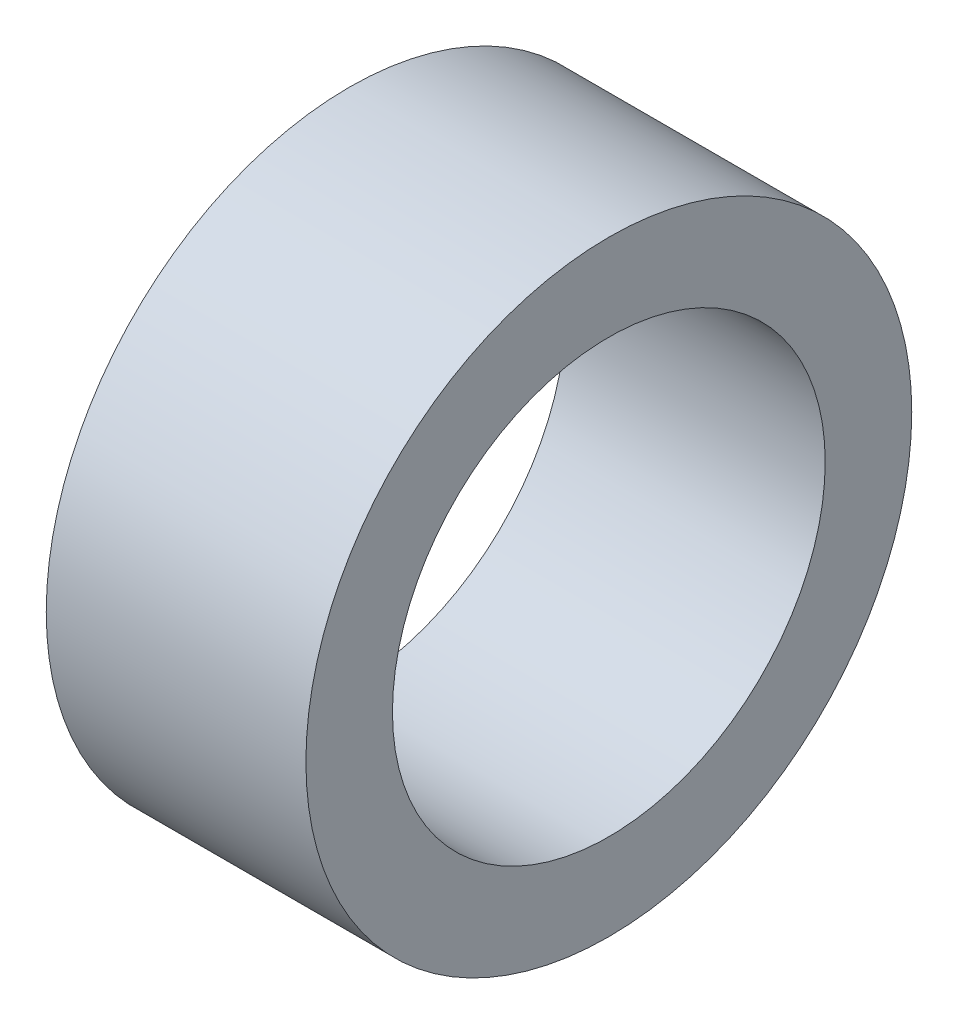
ISO-10303-21;
HEADER;
FILE_DESCRIPTION(('STEP AP214'),'2;1');
FILE_NAME('part.step','',(''),(''),'','','');
FILE_SCHEMA(('AUTOMOTIVE_DESIGN { 1 0 10303 214 1 1 1 1 }'));
ENDSEC;
DATA;
#1=APPLICATION_CONTEXT('core data for automotive mechanical design processes');
#2=APPLICATION_PROTOCOL_DEFINITION('international standard','automotive_design',2000,#1);
#3=PRODUCT_CONTEXT('',#1,'mechanical');
#4=PRODUCT('Part','Part','',(#3));
#5=PRODUCT_RELATED_PRODUCT_CATEGORY('part','',(#4));
#6=PRODUCT_DEFINITION_FORMATION('','',#4);
#7=PRODUCT_DEFINITION_CONTEXT('part definition',#1,'design');
#8=PRODUCT_DEFINITION('design','',#6,#7);
#9=PRODUCT_DEFINITION_SHAPE('','',#8);
#10=(LENGTH_UNIT() NAMED_UNIT(*) SI_UNIT(.MILLI.,.METRE.));
#11=(NAMED_UNIT(*) PLANE_ANGLE_UNIT() SI_UNIT($,.RADIAN.));
#12=(NAMED_UNIT(*) SI_UNIT($,.STERADIAN.) SOLID_ANGLE_UNIT());
#13=UNCERTAINTY_MEASURE_WITH_UNIT(LENGTH_MEASURE(1.E-05),#10,'distance_accuracy_value','');
#14=(GEOMETRIC_REPRESENTATION_CONTEXT(3) GLOBAL_UNCERTAINTY_ASSIGNED_CONTEXT((#13)) GLOBAL_UNIT_ASSIGNED_CONTEXT((#10,
#11,#12)) REPRESENTATION_CONTEXT('',''));
#15=CARTESIAN_POINT('',(0.,0.,0.));
#16=DIRECTION('',(0.,0.,1.));
#17=DIRECTION('',(1.,0.,0.));
#18=AXIS2_PLACEMENT_3D('',#15,#16,#17);
#19=CARTESIAN_POINT('',(6.,0.,0.));
#20=DIRECTION('',(1.,0.,0.));
#21=DIRECTION('',(0.,0.,-1.));
#22=AXIS2_PLACEMENT_3D('',#19,#20,#21);
#23=PLANE('',#22);
#24=CARTESIAN_POINT('',(6.,0.,0.));
#25=DIRECTION('',(1.,0.,0.));
#26=DIRECTION('',(0.,0.,-1.));
#27=AXIS2_PLACEMENT_3D('',#24,#25,#26);
#28=CIRCLE('',#27,7.);
#29=CARTESIAN_POINT('',(6.,0.,-7.));
#30=VERTEX_POINT('',#29);
#31=EDGE_CURVE('E10',#30,#30,#28,.T.);
#32=ORIENTED_EDGE('',*,*,#31,.T.);
#33=EDGE_LOOP('',(#32));
#34=FACE_BOUND('',#33,.T.);
#35=CARTESIAN_POINT('',(6.,0.,0.));
#36=DIRECTION('',(1.,0.,0.));
#37=DIRECTION('',(0.,0.,-1.));
#38=AXIS2_PLACEMENT_3D('',#35,#36,#37);
#39=CIRCLE('',#38,5.);
#40=CARTESIAN_POINT('',(6.,0.,-5.));
#41=VERTEX_POINT('',#40);
#42=EDGE_CURVE('E44',#41,#41,#39,.T.);
#43=ORIENTED_EDGE('',*,*,#42,.F.);
#44=EDGE_LOOP('',(#43));
#45=FACE_BOUND('',#44,.T.);
#46=ADVANCED_FACE('F33',(#34,#45),#23,.T.);
#47=CARTESIAN_POINT('',(0.,0.,0.));
#48=DIRECTION('',(1.,0.,0.));
#49=DIRECTION('',(0.,0.,-1.));
#50=AXIS2_PLACEMENT_3D('',#47,#48,#49);
#51=PLANE('',#50);
#52=CARTESIAN_POINT('',(0.,0.,0.));
#53=DIRECTION('',(1.,0.,0.));
#54=DIRECTION('',(0.,0.,-1.));
#55=AXIS2_PLACEMENT_3D('',#52,#53,#54);
#56=CIRCLE('',#55,7.);
#57=CARTESIAN_POINT('',(0.,0.,-7.));
#58=VERTEX_POINT('',#57);
#59=EDGE_CURVE('E37',#58,#58,#56,.T.);
#60=ORIENTED_EDGE('',*,*,#59,.F.);
#61=EDGE_LOOP('',(#60));
#62=FACE_BOUND('',#61,.T.);
#63=CARTESIAN_POINT('',(0.,0.,0.));
#64=DIRECTION('',(1.,0.,0.));
#65=DIRECTION('',(0.,0.,-1.));
#66=AXIS2_PLACEMENT_3D('',#63,#64,#65);
#67=CIRCLE('',#66,5.);
#68=CARTESIAN_POINT('',(0.,0.,-5.));
#69=VERTEX_POINT('',#68);
#70=EDGE_CURVE('E46',#69,#69,#67,.T.);
#71=ORIENTED_EDGE('',*,*,#70,.T.);
#72=EDGE_LOOP('',(#71));
#73=FACE_BOUND('',#72,.T.);
#74=ADVANCED_FACE('F56',(#62,#73),#51,.F.);
#75=CARTESIAN_POINT('',(6.,0.,0.));
#76=DIRECTION('',(-1.,0.,0.));
#77=DIRECTION('',(0.,0.,1.));
#78=AXIS2_PLACEMENT_3D('',#75,#76,#77);
#79=CYLINDRICAL_SURFACE('',#78,7.);
#80=ORIENTED_EDGE('',*,*,#31,.F.);
#81=EDGE_LOOP('',(#80));
#82=FACE_BOUND('',#81,.T.);
#83=ORIENTED_EDGE('',*,*,#59,.T.);
#84=EDGE_LOOP('',(#83));
#85=FACE_BOUND('',#84,.T.);
#86=ADVANCED_FACE('F35',(#82,#85),#79,.T.);
#87=CARTESIAN_POINT('',(6.,0.,0.));
#88=DIRECTION('',(-1.,0.,0.));
#89=DIRECTION('',(0.,0.,1.));
#90=AXIS2_PLACEMENT_3D('',#87,#88,#89);
#91=CYLINDRICAL_SURFACE('',#90,5.);
#92=ORIENTED_EDGE('',*,*,#42,.T.);
#93=EDGE_LOOP('',(#92));
#94=FACE_BOUND('',#93,.T.);
#95=ORIENTED_EDGE('',*,*,#70,.F.);
#96=EDGE_LOOP('',(#95));
#97=FACE_BOUND('',#96,.T.);
#98=ADVANCED_FACE('F52',(#94,#97),#91,.F.);
#99=CLOSED_SHELL('',(#46,#74,#86,#98));
#100=MANIFOLD_SOLID_BREP('B2',#99);
#101=ADVANCED_BREP_SHAPE_REPRESENTATION('',(#18,#100),#14);
#102=SHAPE_DEFINITION_REPRESENTATION(#9,#101);
ENDSEC;
END-ISO-10303-21;
